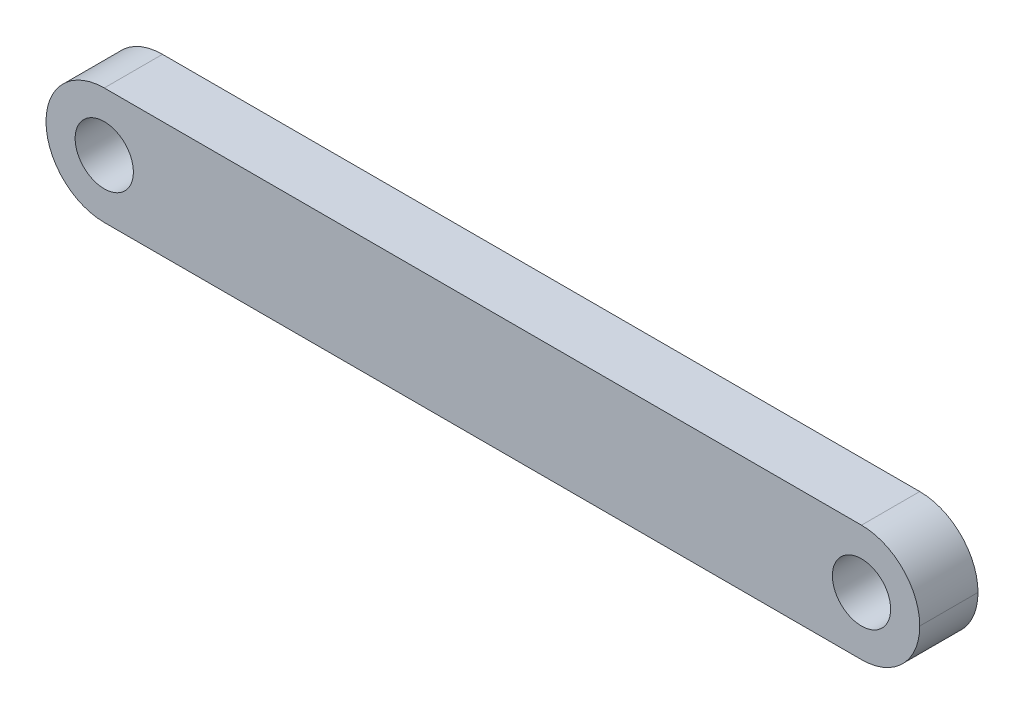
ISO-10303-21;
HEADER;
FILE_DESCRIPTION(('STEP AP214'),'2;1');
FILE_NAME('part.step','',(''),(''),'','','');
FILE_SCHEMA(('AUTOMOTIVE_DESIGN { 1 0 10303 214 1 1 1 1 }'));
ENDSEC;
DATA;
#1=APPLICATION_CONTEXT('core data for automotive mechanical design processes');
#2=APPLICATION_PROTOCOL_DEFINITION('international standard','automotive_design',2000,#1);
#3=PRODUCT_CONTEXT('',#1,'mechanical');
#4=PRODUCT('Part','Part','',(#3));
#5=PRODUCT_RELATED_PRODUCT_CATEGORY('part','',(#4));
#6=PRODUCT_DEFINITION_FORMATION('','',#4);
#7=PRODUCT_DEFINITION_CONTEXT('part definition',#1,'design');
#8=PRODUCT_DEFINITION('design','',#6,#7);
#9=PRODUCT_DEFINITION_SHAPE('','',#8);
#10=(LENGTH_UNIT() NAMED_UNIT(*) SI_UNIT(.MILLI.,.METRE.));
#11=(NAMED_UNIT(*) PLANE_ANGLE_UNIT() SI_UNIT($,.RADIAN.));
#12=(NAMED_UNIT(*) SI_UNIT($,.STERADIAN.) SOLID_ANGLE_UNIT());
#13=UNCERTAINTY_MEASURE_WITH_UNIT(LENGTH_MEASURE(1.E-05),#10,'distance_accuracy_value','');
#14=(GEOMETRIC_REPRESENTATION_CONTEXT(3) GLOBAL_UNCERTAINTY_ASSIGNED_CONTEXT((#13)) GLOBAL_UNIT_ASSIGNED_CONTEXT((#10,
#11,#12)) REPRESENTATION_CONTEXT('',''));
#15=CARTESIAN_POINT('',(0.,0.,0.));
#16=DIRECTION('',(0.,0.,1.));
#17=DIRECTION('',(1.,0.,0.));
#18=AXIS2_PLACEMENT_3D('',#15,#16,#17);
#19=CARTESIAN_POINT('',(0.,0.,10.));
#20=DIRECTION('',(0.,1.,0.));
#21=DIRECTION('',(0.,0.,1.));
#22=AXIS2_PLACEMENT_3D('',#19,#20,#21);
#23=PLANE('',#22);
#24=DIRECTION('',(1.,0.,0.));
#25=VECTOR('',#24,1.);
#26=CARTESIAN_POINT('',(0.,0.,10.));
#27=LINE('',#26,#25);
#28=CARTESIAN_POINT('',(10.,0.,10.));
#29=VERTEX_POINT('',#28);
#30=CARTESIAN_POINT('',(140.,0.,10.));
#31=VERTEX_POINT('',#30);
#32=EDGE_CURVE('E111',#29,#31,#27,.T.);
#33=ORIENTED_EDGE('',*,*,#32,.F.);
#34=DIRECTION('',(0.,0.,-1.));
#35=VECTOR('',#34,1.);
#36=CARTESIAN_POINT('',(10.,0.,10.));
#37=LINE('',#36,#35);
#38=CARTESIAN_POINT('',(10.,0.,0.));
#39=VERTEX_POINT('',#38);
#40=EDGE_CURVE('E95',#29,#39,#37,.T.);
#41=ORIENTED_EDGE('',*,*,#40,.T.);
#42=DIRECTION('',(1.,0.,0.));
#43=VECTOR('',#42,1.);
#44=CARTESIAN_POINT('',(0.,0.,0.));
#45=LINE('',#44,#43);
#46=CARTESIAN_POINT('',(140.,0.,0.));
#47=VERTEX_POINT('',#46);
#48=EDGE_CURVE('E108',#39,#47,#45,.T.);
#49=ORIENTED_EDGE('',*,*,#48,.T.);
#50=DIRECTION('',(0.,0.,-1.));
#51=VECTOR('',#50,1.);
#52=CARTESIAN_POINT('',(140.,0.,10.));
#53=LINE('',#52,#51);
#54=EDGE_CURVE('E112',#47,#31,#53,.F.);
#55=ORIENTED_EDGE('',*,*,#54,.T.);
#56=EDGE_LOOP('',(#33,#41,#49,#55));
#57=FACE_BOUND('',#56,.T.);
#58=ADVANCED_FACE('F37',(#57),#23,.F.);
#59=CARTESIAN_POINT('',(0.,20.,10.));
#60=DIRECTION('',(0.,-1.,0.));
#61=DIRECTION('',(0.,0.,-1.));
#62=AXIS2_PLACEMENT_3D('',#59,#60,#61);
#63=PLANE('',#62);
#64=DIRECTION('',(-1.,0.,0.));
#65=VECTOR('',#64,1.);
#66=CARTESIAN_POINT('',(0.,20.,10.));
#67=LINE('',#66,#65);
#68=CARTESIAN_POINT('',(140.,20.,10.));
#69=VERTEX_POINT('',#68);
#70=CARTESIAN_POINT('',(10.,20.,10.));
#71=VERTEX_POINT('',#70);
#72=EDGE_CURVE('E121',#69,#71,#67,.T.);
#73=ORIENTED_EDGE('',*,*,#72,.F.);
#74=DIRECTION('',(0.,0.,-1.));
#75=VECTOR('',#74,1.);
#76=CARTESIAN_POINT('',(140.,20.,10.));
#77=LINE('',#76,#75);
#78=CARTESIAN_POINT('',(140.,20.,0.));
#79=VERTEX_POINT('',#78);
#80=EDGE_CURVE('E11',#69,#79,#77,.T.);
#81=ORIENTED_EDGE('',*,*,#80,.T.);
#82=DIRECTION('',(-1.,0.,0.));
#83=VECTOR('',#82,1.);
#84=CARTESIAN_POINT('',(0.,20.,0.));
#85=LINE('',#84,#83);
#86=CARTESIAN_POINT('',(10.,20.,0.));
#87=VERTEX_POINT('',#86);
#88=EDGE_CURVE('E117',#79,#87,#85,.T.);
#89=ORIENTED_EDGE('',*,*,#88,.T.);
#90=DIRECTION('',(0.,0.,-1.));
#91=VECTOR('',#90,1.);
#92=CARTESIAN_POINT('',(10.,20.,10.));
#93=LINE('',#92,#91);
#94=EDGE_CURVE('E46',#87,#71,#93,.F.);
#95=ORIENTED_EDGE('',*,*,#94,.T.);
#96=EDGE_LOOP('',(#73,#81,#89,#95));
#97=FACE_BOUND('',#96,.T.);
#98=ADVANCED_FACE('F159',(#97),#63,.F.);
#99=CARTESIAN_POINT('',(0.,0.,10.));
#100=DIRECTION('',(0.,0.,-1.));
#101=DIRECTION('',(-1.,0.,0.));
#102=AXIS2_PLACEMENT_3D('',#99,#100,#101);
#103=PLANE('',#102);
#104=CARTESIAN_POINT('',(140.,10.,10.));
#105=DIRECTION('',(0.,0.,1.));
#106=DIRECTION('',(1.,0.,0.));
#107=AXIS2_PLACEMENT_3D('',#104,#105,#106);
#108=CIRCLE('',#107,5.00000000000002);
#109=CARTESIAN_POINT('',(145.,10.,10.));
#110=VERTEX_POINT('',#109);
#111=EDGE_CURVE('E153',#110,#110,#108,.T.);
#112=ORIENTED_EDGE('',*,*,#111,.F.);
#113=EDGE_LOOP('',(#112));
#114=FACE_BOUND('',#113,.T.);
#115=CARTESIAN_POINT('',(10.,10.,10.));
#116=DIRECTION('',(0.,0.,1.));
#117=DIRECTION('',(1.,0.,0.));
#118=AXIS2_PLACEMENT_3D('',#115,#116,#117);
#119=CIRCLE('',#118,5.);
#120=CARTESIAN_POINT('',(15.,10.,10.));
#121=VERTEX_POINT('',#120);
#122=EDGE_CURVE('E145',#121,#121,#119,.T.);
#123=ORIENTED_EDGE('',*,*,#122,.F.);
#124=EDGE_LOOP('',(#123));
#125=FACE_BOUND('',#124,.T.);
#126=ORIENTED_EDGE('',*,*,#32,.T.);
#127=CARTESIAN_POINT('',(140.,10.,10.));
#128=DIRECTION('',(0.,0.,-1.));
#129=DIRECTION('',(-1.,0.,0.));
#130=AXIS2_PLACEMENT_3D('',#127,#128,#129);
#131=CIRCLE('',#130,10.);
#132=CARTESIAN_POINT('',(150.,10.,10.));
#133=VERTEX_POINT('',#132);
#134=EDGE_CURVE('E133',#31,#133,#131,.F.);
#135=ORIENTED_EDGE('',*,*,#134,.T.);
#136=CARTESIAN_POINT('',(140.,10.,10.));
#137=DIRECTION('',(0.,0.,-1.));
#138=DIRECTION('',(-1.,0.,0.));
#139=AXIS2_PLACEMENT_3D('',#136,#137,#138);
#140=CIRCLE('',#139,10.);
#141=EDGE_CURVE('E60',#133,#69,#140,.F.);
#142=ORIENTED_EDGE('',*,*,#141,.T.);
#143=ORIENTED_EDGE('',*,*,#72,.T.);
#144=CARTESIAN_POINT('',(10.,10.,10.));
#145=DIRECTION('',(0.,0.,-1.));
#146=DIRECTION('',(-1.,0.,0.));
#147=AXIS2_PLACEMENT_3D('',#144,#145,#146);
#148=CIRCLE('',#147,10.);
#149=CARTESIAN_POINT('',(0.,10.,10.));
#150=VERTEX_POINT('',#149);
#151=EDGE_CURVE('E128',#71,#150,#148,.F.);
#152=ORIENTED_EDGE('',*,*,#151,.T.);
#153=CARTESIAN_POINT('',(10.,10.,10.));
#154=DIRECTION('',(0.,0.,-1.));
#155=DIRECTION('',(-1.,0.,0.));
#156=AXIS2_PLACEMENT_3D('',#153,#154,#155);
#157=CIRCLE('',#156,10.);
#158=EDGE_CURVE('E130',#150,#29,#157,.F.);
#159=ORIENTED_EDGE('',*,*,#158,.T.);
#160=EDGE_LOOP('',(#126,#135,#142,#143,#152,#159));
#161=FACE_BOUND('',#160,.T.);
#162=ADVANCED_FACE('F135',(#114,#125,#161),#103,.F.);
#163=CARTESIAN_POINT('',(0.,0.,0.));
#164=DIRECTION('',(0.,0.,-1.));
#165=DIRECTION('',(-1.,0.,0.));
#166=AXIS2_PLACEMENT_3D('',#163,#164,#165);
#167=PLANE('',#166);
#168=CARTESIAN_POINT('',(140.,10.,0.));
#169=DIRECTION('',(0.,0.,1.));
#170=DIRECTION('',(1.,0.,0.));
#171=AXIS2_PLACEMENT_3D('',#168,#169,#170);
#172=CIRCLE('',#171,5.00000000000002);
#173=CARTESIAN_POINT('',(145.,10.,0.));
#174=VERTEX_POINT('',#173);
#175=EDGE_CURVE('E150',#174,#174,#172,.T.);
#176=ORIENTED_EDGE('',*,*,#175,.T.);
#177=EDGE_LOOP('',(#176));
#178=FACE_BOUND('',#177,.T.);
#179=CARTESIAN_POINT('',(10.,10.,0.));
#180=DIRECTION('',(0.,0.,1.));
#181=DIRECTION('',(1.,0.,0.));
#182=AXIS2_PLACEMENT_3D('',#179,#180,#181);
#183=CIRCLE('',#182,5.);
#184=CARTESIAN_POINT('',(15.,10.,0.));
#185=VERTEX_POINT('',#184);
#186=EDGE_CURVE('E143',#185,#185,#183,.T.);
#187=ORIENTED_EDGE('',*,*,#186,.T.);
#188=EDGE_LOOP('',(#187));
#189=FACE_BOUND('',#188,.T.);
#190=CARTESIAN_POINT('',(140.,10.,0.));
#191=DIRECTION('',(0.,0.,-1.));
#192=DIRECTION('',(-1.,0.,0.));
#193=AXIS2_PLACEMENT_3D('',#190,#191,#192);
#194=CIRCLE('',#193,10.);
#195=CARTESIAN_POINT('',(150.,10.,0.));
#196=VERTEX_POINT('',#195);
#197=EDGE_CURVE('E101',#79,#196,#194,.T.);
#198=ORIENTED_EDGE('',*,*,#197,.T.);
#199=CARTESIAN_POINT('',(140.,10.,0.));
#200=DIRECTION('',(0.,0.,-1.));
#201=DIRECTION('',(-1.,0.,0.));
#202=AXIS2_PLACEMENT_3D('',#199,#200,#201);
#203=CIRCLE('',#202,10.);
#204=EDGE_CURVE('E116',#196,#47,#203,.T.);
#205=ORIENTED_EDGE('',*,*,#204,.T.);
#206=ORIENTED_EDGE('',*,*,#48,.F.);
#207=CARTESIAN_POINT('',(10.,10.,0.));
#208=DIRECTION('',(0.,0.,-1.));
#209=DIRECTION('',(-1.,0.,0.));
#210=AXIS2_PLACEMENT_3D('',#207,#208,#209);
#211=CIRCLE('',#210,10.);
#212=CARTESIAN_POINT('',(0.,10.,0.));
#213=VERTEX_POINT('',#212);
#214=EDGE_CURVE('E91',#39,#213,#211,.T.);
#215=ORIENTED_EDGE('',*,*,#214,.T.);
#216=CARTESIAN_POINT('',(10.,10.,0.));
#217=DIRECTION('',(0.,0.,-1.));
#218=DIRECTION('',(-1.,0.,0.));
#219=AXIS2_PLACEMENT_3D('',#216,#217,#218);
#220=CIRCLE('',#219,10.);
#221=EDGE_CURVE('E102',#213,#87,#220,.T.);
#222=ORIENTED_EDGE('',*,*,#221,.T.);
#223=ORIENTED_EDGE('',*,*,#88,.F.);
#224=EDGE_LOOP('',(#198,#205,#206,#215,#222,#223));
#225=FACE_BOUND('',#224,.T.);
#226=ADVANCED_FACE('F114',(#178,#189,#225),#167,.T.);
#227=CARTESIAN_POINT('',(10.,10.,10.));
#228=DIRECTION('',(0.,0.,-1.));
#229=DIRECTION('',(-1.,0.,0.));
#230=AXIS2_PLACEMENT_3D('',#227,#228,#229);
#231=CYLINDRICAL_SURFACE('',#230,10.);
#232=DIRECTION('',(0.,0.,-1.));
#233=VECTOR('',#232,1.);
#234=CARTESIAN_POINT('',(0.,10.,10.));
#235=LINE('',#234,#233);
#236=EDGE_CURVE('E97',#150,#213,#235,.T.);
#237=ORIENTED_EDGE('',*,*,#236,.F.);
#238=ORIENTED_EDGE('',*,*,#151,.F.);
#239=ORIENTED_EDGE('',*,*,#94,.F.);
#240=ORIENTED_EDGE('',*,*,#221,.F.);
#241=EDGE_LOOP('',(#237,#238,#239,#240));
#242=FACE_BOUND('',#241,.T.);
#243=ADVANCED_FACE('F157',(#242),#231,.T.);
#244=CARTESIAN_POINT('',(10.,10.,10.));
#245=DIRECTION('',(0.,0.,-1.));
#246=DIRECTION('',(-1.,0.,0.));
#247=AXIS2_PLACEMENT_3D('',#244,#245,#246);
#248=CYLINDRICAL_SURFACE('',#247,10.);
#249=ORIENTED_EDGE('',*,*,#158,.F.);
#250=ORIENTED_EDGE('',*,*,#236,.T.);
#251=ORIENTED_EDGE('',*,*,#214,.F.);
#252=ORIENTED_EDGE('',*,*,#40,.F.);
#253=EDGE_LOOP('',(#249,#250,#251,#252));
#254=FACE_BOUND('',#253,.T.);
#255=ADVANCED_FACE('F94',(#254),#248,.T.);
#256=CARTESIAN_POINT('',(140.,10.,10.));
#257=DIRECTION('',(0.,0.,-1.));
#258=DIRECTION('',(-1.,0.,0.));
#259=AXIS2_PLACEMENT_3D('',#256,#257,#258);
#260=CYLINDRICAL_SURFACE('',#259,10.);
#261=ORIENTED_EDGE('',*,*,#80,.F.);
#262=ORIENTED_EDGE('',*,*,#141,.F.);
#263=DIRECTION('',(0.,0.,-1.));
#264=VECTOR('',#263,1.);
#265=CARTESIAN_POINT('',(150.,10.,10.));
#266=LINE('',#265,#264);
#267=EDGE_CURVE('E41',#196,#133,#266,.F.);
#268=ORIENTED_EDGE('',*,*,#267,.F.);
#269=ORIENTED_EDGE('',*,*,#197,.F.);
#270=EDGE_LOOP('',(#261,#262,#268,#269));
#271=FACE_BOUND('',#270,.T.);
#272=ADVANCED_FACE('F39',(#271),#260,.T.);
#273=CARTESIAN_POINT('',(140.,10.,10.));
#274=DIRECTION('',(0.,0.,-1.));
#275=DIRECTION('',(-1.,0.,0.));
#276=AXIS2_PLACEMENT_3D('',#273,#274,#275);
#277=CYLINDRICAL_SURFACE('',#276,10.);
#278=ORIENTED_EDGE('',*,*,#134,.F.);
#279=ORIENTED_EDGE('',*,*,#54,.F.);
#280=ORIENTED_EDGE('',*,*,#204,.F.);
#281=ORIENTED_EDGE('',*,*,#267,.T.);
#282=EDGE_LOOP('',(#278,#279,#280,#281));
#283=FACE_BOUND('',#282,.T.);
#284=ADVANCED_FACE('F142',(#283),#277,.T.);
#285=CARTESIAN_POINT('',(10.,10.,0.));
#286=DIRECTION('',(0.,0.,1.));
#287=DIRECTION('',(1.,0.,0.));
#288=AXIS2_PLACEMENT_3D('',#285,#286,#287);
#289=CYLINDRICAL_SURFACE('',#288,5.);
#290=ORIENTED_EDGE('',*,*,#186,.F.);
#291=EDGE_LOOP('',(#290));
#292=FACE_BOUND('',#291,.T.);
#293=ORIENTED_EDGE('',*,*,#122,.T.);
#294=EDGE_LOOP('',(#293));
#295=FACE_BOUND('',#294,.T.);
#296=ADVANCED_FACE('F175',(#292,#295),#289,.F.);
#297=CARTESIAN_POINT('',(140.,10.,0.));
#298=DIRECTION('',(0.,0.,1.));
#299=DIRECTION('',(1.,0.,0.));
#300=AXIS2_PLACEMENT_3D('',#297,#298,#299);
#301=CYLINDRICAL_SURFACE('',#300,5.00000000000002);
#302=ORIENTED_EDGE('',*,*,#175,.F.);
#303=EDGE_LOOP('',(#302));
#304=FACE_BOUND('',#303,.T.);
#305=ORIENTED_EDGE('',*,*,#111,.T.);
#306=EDGE_LOOP('',(#305));
#307=FACE_BOUND('',#306,.T.);
#308=ADVANCED_FACE('F180',(#304,#307),#301,.F.);
#309=CLOSED_SHELL('',(#58,#98,#162,#226,#243,#255,#272,#284,#296,#308));
#310=MANIFOLD_SOLID_BREP('B2',#309);
#311=ADVANCED_BREP_SHAPE_REPRESENTATION('',(#18,#310),#14);
#312=SHAPE_DEFINITION_REPRESENTATION(#9,#311);
ENDSEC;
END-ISO-10303-21;
